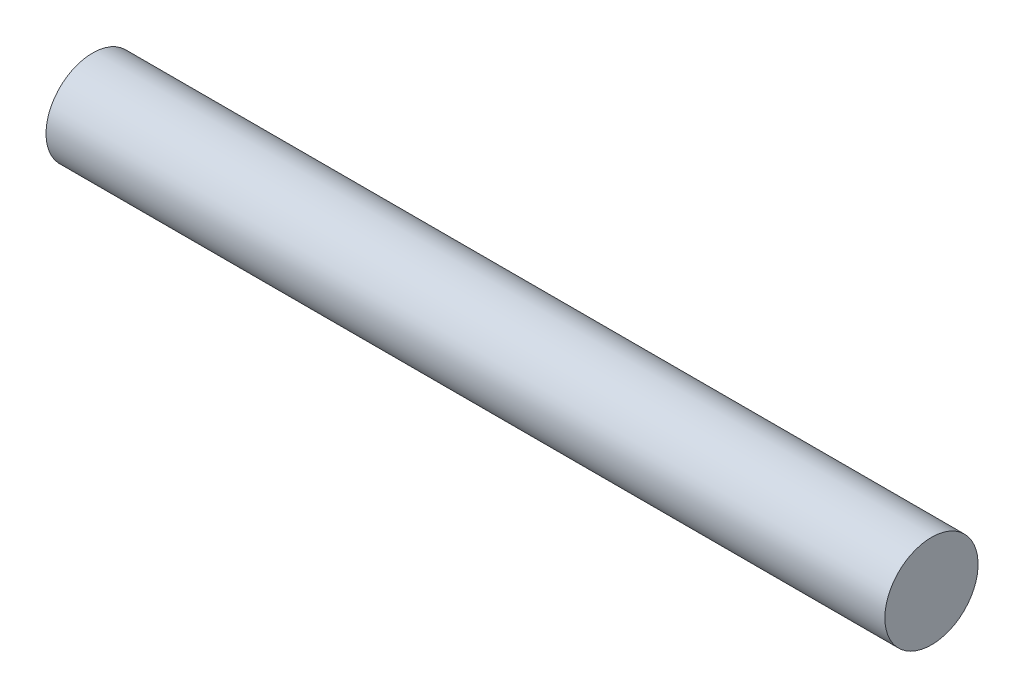
ISO-10303-21;
HEADER;
FILE_DESCRIPTION(('STEP AP214'),'2;1');
FILE_NAME('part.step','',(''),(''),'','','');
FILE_SCHEMA(('AUTOMOTIVE_DESIGN { 1 0 10303 214 1 1 1 1 }'));
ENDSEC;
DATA;
#1=APPLICATION_CONTEXT('core data for automotive mechanical design processes');
#2=APPLICATION_PROTOCOL_DEFINITION('international standard','automotive_design',2000,#1);
#3=PRODUCT_CONTEXT('',#1,'mechanical');
#4=PRODUCT('Part','Part','',(#3));
#5=PRODUCT_RELATED_PRODUCT_CATEGORY('part','',(#4));
#6=PRODUCT_DEFINITION_FORMATION('','',#4);
#7=PRODUCT_DEFINITION_CONTEXT('part definition',#1,'design');
#8=PRODUCT_DEFINITION('design','',#6,#7);
#9=PRODUCT_DEFINITION_SHAPE('','',#8);
#10=(LENGTH_UNIT() NAMED_UNIT(*) SI_UNIT(.MILLI.,.METRE.));
#11=(NAMED_UNIT(*) PLANE_ANGLE_UNIT() SI_UNIT($,.RADIAN.));
#12=(NAMED_UNIT(*) SI_UNIT($,.STERADIAN.) SOLID_ANGLE_UNIT());
#13=UNCERTAINTY_MEASURE_WITH_UNIT(LENGTH_MEASURE(1.E-05),#10,'distance_accuracy_value','');
#14=(GEOMETRIC_REPRESENTATION_CONTEXT(3) GLOBAL_UNCERTAINTY_ASSIGNED_CONTEXT((#13)) GLOBAL_UNIT_ASSIGNED_CONTEXT((#10,
#11,#12)) REPRESENTATION_CONTEXT('',''));
#15=CARTESIAN_POINT('',(0.,0.,0.));
#16=DIRECTION('',(0.,0.,1.));
#17=DIRECTION('',(1.,0.,0.));
#18=AXIS2_PLACEMENT_3D('',#15,#16,#17);
#19=CARTESIAN_POINT('',(-28.575,0.,-3.175));
#20=DIRECTION('',(1.,0.,0.));
#21=DIRECTION('',(0.,0.,-1.));
#22=AXIS2_PLACEMENT_3D('',#19,#20,#21);
#23=PLANE('',#22);
#24=CARTESIAN_POINT('',(-28.575,0.,0.));
#25=DIRECTION('',(-1.,0.,0.));
#26=DIRECTION('',(0.,0.,1.));
#27=AXIS2_PLACEMENT_3D('',#24,#25,#26);
#28=CIRCLE('',#27,3.17499999999999);
#29=CARTESIAN_POINT('',(-28.575,0.,3.17499999999998));
#30=VERTEX_POINT('',#29);
#31=EDGE_CURVE('E38',#30,#30,#28,.T.);
#32=ORIENTED_EDGE('',*,*,#31,.T.);
#33=EDGE_LOOP('',(#32));
#34=FACE_BOUND('',#33,.T.);
#35=ADVANCED_FACE('F32',(#34),#23,.F.);
#36=CARTESIAN_POINT('',(28.575,0.,-3.175));
#37=DIRECTION('',(-1.,0.,0.));
#38=DIRECTION('',(0.,0.,1.));
#39=AXIS2_PLACEMENT_3D('',#36,#37,#38);
#40=PLANE('',#39);
#41=CARTESIAN_POINT('',(28.575,0.,0.));
#42=DIRECTION('',(-1.,0.,0.));
#43=DIRECTION('',(0.,0.,1.));
#44=AXIS2_PLACEMENT_3D('',#41,#42,#43);
#45=CIRCLE('',#44,3.17499999999999);
#46=CARTESIAN_POINT('',(28.575,0.,3.17499999999998));
#47=VERTEX_POINT('',#46);
#48=EDGE_CURVE('E10',#47,#47,#45,.T.);
#49=ORIENTED_EDGE('',*,*,#48,.F.);
#50=EDGE_LOOP('',(#49));
#51=FACE_BOUND('',#50,.T.);
#52=ADVANCED_FACE('F47',(#51),#40,.F.);
#53=CARTESIAN_POINT('',(-28.575,0.,0.));
#54=DIRECTION('',(-1.,0.,0.));
#55=DIRECTION('',(0.,0.,1.));
#56=AXIS2_PLACEMENT_3D('',#53,#54,#55);
#57=CYLINDRICAL_SURFACE('',#56,3.17499999999999);
#58=ORIENTED_EDGE('',*,*,#31,.F.);
#59=EDGE_LOOP('',(#58));
#60=FACE_BOUND('',#59,.T.);
#61=ORIENTED_EDGE('',*,*,#48,.T.);
#62=EDGE_LOOP('',(#61));
#63=FACE_BOUND('',#62,.T.);
#64=ADVANCED_FACE('F45',(#60,#63),#57,.T.);
#65=CLOSED_SHELL('',(#35,#52,#64));
#66=MANIFOLD_SOLID_BREP('B2',#65);
#67=ADVANCED_BREP_SHAPE_REPRESENTATION('',(#18,#66),#14);
#68=SHAPE_DEFINITION_REPRESENTATION(#9,#67);
ENDSEC;
END-ISO-10303-21;
